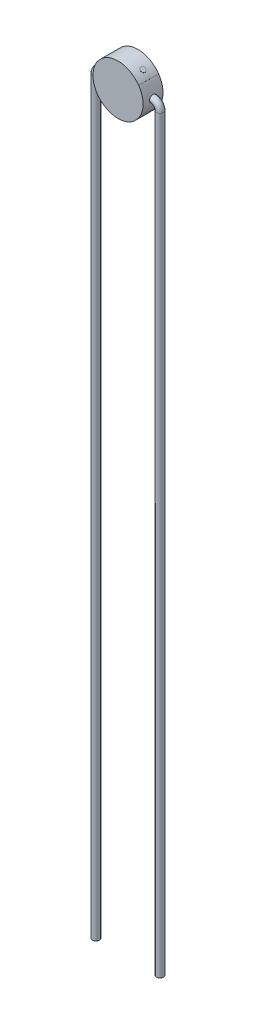
ISO-10303-21;
HEADER;
FILE_DESCRIPTION(('STEP AP214'),'2;1');
FILE_NAME('part.step','',(''),(''),'','','');
FILE_SCHEMA(('AUTOMOTIVE_DESIGN { 1 0 10303 214 1 1 1 1 }'));
ENDSEC;
DATA;
#1=APPLICATION_CONTEXT('core data for automotive mechanical design processes');
#2=APPLICATION_PROTOCOL_DEFINITION('international standard','automotive_design',2000,#1);
#3=PRODUCT_CONTEXT('',#1,'mechanical');
#4=PRODUCT('Part','Part','',(#3));
#5=PRODUCT_RELATED_PRODUCT_CATEGORY('part','',(#4));
#6=PRODUCT_DEFINITION_FORMATION('','',#4);
#7=PRODUCT_DEFINITION_CONTEXT('part definition',#1,'design');
#8=PRODUCT_DEFINITION('design','',#6,#7);
#9=PRODUCT_DEFINITION_SHAPE('','',#8);
#10=(LENGTH_UNIT() NAMED_UNIT(*) SI_UNIT(.MILLI.,.METRE.));
#11=(NAMED_UNIT(*) PLANE_ANGLE_UNIT() SI_UNIT($,.RADIAN.));
#12=(NAMED_UNIT(*) SI_UNIT($,.STERADIAN.) SOLID_ANGLE_UNIT());
#13=UNCERTAINTY_MEASURE_WITH_UNIT(LENGTH_MEASURE(1.E-05),#10,'distance_accuracy_value','');
#14=(GEOMETRIC_REPRESENTATION_CONTEXT(3) GLOBAL_UNCERTAINTY_ASSIGNED_CONTEXT((#13)) GLOBAL_UNIT_ASSIGNED_CONTEXT((#10,
#11,#12)) REPRESENTATION_CONTEXT('',''));
#15=CARTESIAN_POINT('',(0.,0.,0.));
#16=DIRECTION('',(0.,0.,1.));
#17=DIRECTION('',(1.,0.,0.));
#18=AXIS2_PLACEMENT_3D('',#15,#16,#17);
#19=CARTESIAN_POINT('',(-2.51000000000001,0.,0.));
#20=DIRECTION('',(-1.,0.,0.));
#21=DIRECTION('',(0.,0.,1.));
#22=AXIS2_PLACEMENT_3D('',#19,#20,#21);
#23=PLANE('',#22);
#24=CARTESIAN_POINT('',(-2.51000000000001,0.,0.));
#25=DIRECTION('',(-1.,0.,0.));
#26=DIRECTION('',(0.,0.,1.));
#27=AXIS2_PLACEMENT_3D('',#24,#25,#26);
#28=CIRCLE('',#27,0.35);
#29=CARTESIAN_POINT('',(-2.51,0.,0.350000000000018));
#30=VERTEX_POINT('',#29);
#31=EDGE_CURVE('E95',#30,#30,#28,.T.);
#32=ORIENTED_EDGE('',*,*,#31,.F.);
#33=EDGE_LOOP('',(#32));
#34=FACE_BOUND('',#33,.T.);
#35=ADVANCED_FACE('F83',(#34),#23,.F.);
#36=CARTESIAN_POINT('',(-3.21000000000002,-75.7,0.));
#37=DIRECTION('',(0.,-1.,0.));
#38=DIRECTION('',(0.,0.,1.));
#39=AXIS2_PLACEMENT_3D('',#36,#37,#38);
#40=PLANE('',#39);
#41=CARTESIAN_POINT('',(-3.21000000000002,-75.7,0.));
#42=DIRECTION('',(0.,-1.,0.));
#43=DIRECTION('',(0.,0.,1.));
#44=AXIS2_PLACEMENT_3D('',#41,#42,#43);
#45=CIRCLE('',#44,0.35);
#46=CARTESIAN_POINT('',(-3.21000000000001,-75.7,0.350000000000022));
#47=VERTEX_POINT('',#46);
#48=EDGE_CURVE('E15',#47,#47,#45,.T.);
#49=ORIENTED_EDGE('',*,*,#48,.T.);
#50=EDGE_LOOP('',(#49));
#51=FACE_BOUND('',#50,.T.);
#52=ADVANCED_FACE('F98',(#51),#40,.T.);
#53=CARTESIAN_POINT('',(-2.51000000000001,-0.7,0.));
#54=DIRECTION('',(0.,0.,1.));
#55=DIRECTION('',(1.,0.,0.));
#56=AXIS2_PLACEMENT_3D('',#53,#54,#55);
#57=TOROIDAL_SURFACE('',#56,0.7,0.35);
#58=CARTESIAN_POINT('',(-3.21000000000001,-0.7,0.));
#59=DIRECTION('',(0.,-1.,0.));
#60=DIRECTION('',(0.,0.,1.));
#61=AXIS2_PLACEMENT_3D('',#58,#59,#60);
#62=CIRCLE('',#61,0.35);
#63=CARTESIAN_POINT('',(-3.21,-0.7,0.350000000000022));
#64=VERTEX_POINT('',#63);
#65=EDGE_CURVE('E90',#64,#64,#62,.T.);
#66=ORIENTED_EDGE('',*,*,#65,.F.);
#67=EDGE_LOOP('',(#66));
#68=FACE_BOUND('',#67,.T.);
#69=ORIENTED_EDGE('',*,*,#31,.T.);
#70=EDGE_LOOP('',(#69));
#71=FACE_BOUND('',#70,.T.);
#72=ADVANCED_FACE('F103',(#68,#71),#57,.T.);
#73=CARTESIAN_POINT('',(-3.21000000000001,-0.7,0.));
#74=DIRECTION('',(0.,-1.,0.));
#75=DIRECTION('',(1.,0.,0.));
#76=AXIS2_PLACEMENT_3D('',#73,#74,#75);
#77=CYLINDRICAL_SURFACE('',#76,0.35);
#78=ORIENTED_EDGE('',*,*,#48,.F.);
#79=EDGE_LOOP('',(#78));
#80=FACE_BOUND('',#79,.T.);
#81=ORIENTED_EDGE('',*,*,#65,.T.);
#82=EDGE_LOOP('',(#81));
#83=FACE_BOUND('',#82,.T.);
#84=ADVANCED_FACE('F100',(#80,#83),#77,.T.);
#85=CLOSED_SHELL('',(#35,#52,#72,#84));
#86=MANIFOLD_SOLID_BREP('B2',#85);
#87=CARTESIAN_POINT('',(2.51,0.,0.));
#88=DIRECTION('',(-1.,0.,0.));
#89=DIRECTION('',(0.,-1.,0.));
#90=AXIS2_PLACEMENT_3D('',#87,#88,#89);
#91=PLANE('',#90);
#92=CARTESIAN_POINT('',(2.51,0.,0.));
#93=DIRECTION('',(-1.,0.,0.));
#94=DIRECTION('',(0.,-1.,0.));
#95=AXIS2_PLACEMENT_3D('',#92,#93,#94);
#96=CIRCLE('',#95,0.35);
#97=CARTESIAN_POINT('',(2.51,-0.35,0.));
#98=VERTEX_POINT('',#97);
#99=EDGE_CURVE('E166',#98,#98,#96,.T.);
#100=ORIENTED_EDGE('',*,*,#99,.T.);
#101=EDGE_LOOP('',(#100));
#102=FACE_BOUND('',#101,.T.);
#103=ADVANCED_FACE('F154',(#102),#91,.T.);
#104=CARTESIAN_POINT('',(3.21000000000001,-75.7,0.));
#105=DIRECTION('',(0.,1.,0.));
#106=DIRECTION('',(-1.,0.,0.));
#107=AXIS2_PLACEMENT_3D('',#104,#105,#106);
#108=PLANE('',#107);
#109=CARTESIAN_POINT('',(3.21000000000001,-75.7,0.));
#110=DIRECTION('',(0.,1.,0.));
#111=DIRECTION('',(-1.,0.,0.));
#112=AXIS2_PLACEMENT_3D('',#109,#110,#111);
#113=CIRCLE('',#112,0.35);
#114=CARTESIAN_POINT('',(2.86000000000001,-75.7,0.));
#115=VERTEX_POINT('',#114);
#116=EDGE_CURVE('E81',#115,#115,#113,.T.);
#117=ORIENTED_EDGE('',*,*,#116,.F.);
#118=EDGE_LOOP('',(#117));
#119=FACE_BOUND('',#118,.T.);
#120=ADVANCED_FACE('F172',(#119),#108,.F.);
#121=CARTESIAN_POINT('',(2.51,-0.7,0.));
#122=DIRECTION('',(0.,0.,-1.));
#123=DIRECTION('',(-1.,0.,0.));
#124=AXIS2_PLACEMENT_3D('',#121,#122,#123);
#125=TOROIDAL_SURFACE('',#124,0.7,0.35);
#126=CARTESIAN_POINT('',(3.21000000000001,-0.700000000000006,0.));
#127=DIRECTION('',(0.,1.,0.));
#128=DIRECTION('',(-1.,0.,0.));
#129=AXIS2_PLACEMENT_3D('',#126,#127,#128);
#130=CIRCLE('',#129,0.35);
#131=CARTESIAN_POINT('',(2.86000000000001,-0.700000000000006,0.));
#132=VERTEX_POINT('',#131);
#133=EDGE_CURVE('E161',#132,#132,#130,.T.);
#134=ORIENTED_EDGE('',*,*,#133,.T.);
#135=EDGE_LOOP('',(#134));
#136=FACE_BOUND('',#135,.T.);
#137=ORIENTED_EDGE('',*,*,#99,.F.);
#138=EDGE_LOOP('',(#137));
#139=FACE_BOUND('',#138,.T.);
#140=ADVANCED_FACE('F174',(#136,#139),#125,.T.);
#141=CARTESIAN_POINT('',(3.21,-0.700000000000006,0.));
#142=DIRECTION('',(0.,-1.,0.));
#143=DIRECTION('',(1.,0.,0.));
#144=AXIS2_PLACEMENT_3D('',#141,#142,#143);
#145=CYLINDRICAL_SURFACE('',#144,0.35);
#146=ORIENTED_EDGE('',*,*,#116,.T.);
#147=EDGE_LOOP('',(#146));
#148=FACE_BOUND('',#147,.T.);
#149=ORIENTED_EDGE('',*,*,#133,.F.);
#150=EDGE_LOOP('',(#149));
#151=FACE_BOUND('',#150,.T.);
#152=ADVANCED_FACE('F169',(#148,#151),#145,.T.);
#153=CLOSED_SHELL('',(#103,#120,#140,#152));
#154=MANIFOLD_SOLID_BREP('B9',#153);
#155=CARTESIAN_POINT('',(1.506,2.008,0.));
#156=DIRECTION('',(-0.6,-0.8,0.));
#157=DIRECTION('',(0.8,-0.6,0.));
#158=AXIS2_PLACEMENT_3D('',#155,#156,#157);
#159=CYLINDRICAL_SURFACE('',#158,0.25);
#160=CARTESIAN_POINT('',(1.506,2.008,0.));
#161=DIRECTION('',(0.6,0.8,0.));
#162=DIRECTION('',(-0.8,0.6,0.));
#163=AXIS2_PLACEMENT_3D('',#160,#161,#162);
#164=CIRCLE('',#163,0.25);
#165=CARTESIAN_POINT('',(1.306,2.158,0.));
#166=VERTEX_POINT('',#165);
#167=EDGE_CURVE('E153',#166,#166,#164,.T.);
#168=ORIENTED_EDGE('',*,*,#167,.F.);
#169=EDGE_LOOP('',(#168));
#170=FACE_BOUND('',#169,.T.);
#171=CARTESIAN_POINT('',(1.5,2.,0.));
#172=DIRECTION('',(0.6,0.8,0.));
#173=DIRECTION('',(-0.8,0.6,0.));
#174=AXIS2_PLACEMENT_3D('',#171,#172,#173);
#175=CIRCLE('',#174,0.25);
#176=CARTESIAN_POINT('',(1.3,2.15,0.));
#177=VERTEX_POINT('',#176);
#178=EDGE_CURVE('E225',#177,#177,#175,.T.);
#179=ORIENTED_EDGE('',*,*,#178,.T.);
#180=EDGE_LOOP('',(#179));
#181=FACE_BOUND('',#180,.T.);
#182=ADVANCED_FACE('F222',(#170,#181),#159,.T.);
#183=CARTESIAN_POINT('',(1.506,2.008,0.));
#184=DIRECTION('',(0.6,0.8,0.));
#185=DIRECTION('',(-0.8,0.6,0.));
#186=AXIS2_PLACEMENT_3D('',#183,#184,#185);
#187=PLANE('',#186);
#188=ORIENTED_EDGE('',*,*,#167,.T.);
#189=EDGE_LOOP('',(#188));
#190=FACE_BOUND('',#189,.T.);
#191=ADVANCED_FACE('F237',(#190),#187,.T.);
#192=CARTESIAN_POINT('',(1.5,2.,0.));
#193=DIRECTION('',(0.6,0.8,0.));
#194=DIRECTION('',(-0.8,0.6,0.));
#195=AXIS2_PLACEMENT_3D('',#192,#193,#194);
#196=PLANE('',#195);
#197=ORIENTED_EDGE('',*,*,#178,.F.);
#198=EDGE_LOOP('',(#197));
#199=FACE_BOUND('',#198,.T.);
#200=ADVANCED_FACE('F235',(#199),#196,.F.);
#201=CLOSED_SHELL('',(#182,#191,#200));
#202=MANIFOLD_SOLID_BREP('B75',#201);
#203=CARTESIAN_POINT('',(0.,0.,1.));
#204=DIRECTION('',(0.,0.,-1.));
#205=DIRECTION('',(-1.,0.,0.));
#206=AXIS2_PLACEMENT_3D('',#203,#204,#205);
#207=CYLINDRICAL_SURFACE('',#206,2.5);
#208=DIRECTION('',(0.,0.,1.));
#209=VECTOR('',#208,1.);
#210=CARTESIAN_POINT('',(-2.0633390372742,-1.41160618348759,-1.));
#211=LINE('',#210,#209);
#212=CARTESIAN_POINT('',(-2.0633390372742,-1.41160618348759,-1.));
#213=VERTEX_POINT('',#212);
#214=CARTESIAN_POINT('',(-2.0633390372742,-1.41160618348759,1.));
#215=VERTEX_POINT('',#214);
#216=EDGE_CURVE('E361',#213,#215,#211,.T.);
#217=ORIENTED_EDGE('',*,*,#216,.F.);
#218=CARTESIAN_POINT('',(0.,0.,-1.));
#219=DIRECTION('',(0.,0.,1.));
#220=DIRECTION('',(1.,0.,0.));
#221=AXIS2_PLACEMENT_3D('',#218,#219,#220);
#222=CIRCLE('',#221,2.5);
#223=CARTESIAN_POINT('',(2.0633390372742,-1.41160618348759,-1.));
#224=VERTEX_POINT('',#223);
#225=EDGE_CURVE('E388',#213,#224,#222,.T.);
#226=ORIENTED_EDGE('',*,*,#225,.T.);
#227=DIRECTION('',(0.,0.,1.));
#228=VECTOR('',#227,1.);
#229=CARTESIAN_POINT('',(2.0633390372742,-1.41160618348759,-1.));
#230=LINE('',#229,#228);
#231=CARTESIAN_POINT('',(2.0633390372742,-1.41160618348759,1.));
#232=VERTEX_POINT('',#231);
#233=EDGE_CURVE('E377',#224,#232,#230,.T.);
#234=ORIENTED_EDGE('',*,*,#233,.T.);
#235=CARTESIAN_POINT('',(0.,0.,1.));
#236=DIRECTION('',(0.,0.,1.));
#237=DIRECTION('',(1.,0.,0.));
#238=AXIS2_PLACEMENT_3D('',#235,#236,#237);
#239=CIRCLE('',#238,2.5);
#240=EDGE_CURVE('E275',#215,#232,#239,.T.);
#241=ORIENTED_EDGE('',*,*,#240,.F.);
#242=EDGE_LOOP('',(#217,#226,#234,#241));
#243=FACE_BOUND('',#242,.T.);
#244=ADVANCED_FACE('F267',(#243),#207,.T.);
#245=DIRECTION('',(0.,0.,1.));
#246=VECTOR('',#245,1.);
#247=CARTESIAN_POINT('',(-2.0633390372742,1.41160618348759,-1.));
#248=LINE('',#247,#246);
#249=CARTESIAN_POINT('',(-2.0633390372742,1.41160618348759,-1.));
#250=VERTEX_POINT('',#249);
#251=CARTESIAN_POINT('',(-2.0633390372742,1.41160618348759,1.));
#252=VERTEX_POINT('',#251);
#253=EDGE_CURVE('E289',#250,#252,#248,.T.);
#254=ORIENTED_EDGE('',*,*,#253,.T.);
#255=CARTESIAN_POINT('',(2.0633390372742,1.41160618348759,1.));
#256=VERTEX_POINT('',#255);
#257=EDGE_CURVE('E220',#256,#252,#239,.T.);
#258=ORIENTED_EDGE('',*,*,#257,.F.);
#259=DIRECTION('',(0.,0.,1.));
#260=VECTOR('',#259,1.);
#261=CARTESIAN_POINT('',(2.0633390372742,1.41160618348759,-1.));
#262=LINE('',#261,#260);
#263=CARTESIAN_POINT('',(2.0633390372742,1.41160618348759,-1.));
#264=VERTEX_POINT('',#263);
#265=EDGE_CURVE('E385',#264,#256,#262,.T.);
#266=ORIENTED_EDGE('',*,*,#265,.F.);
#267=EDGE_CURVE('E270',#264,#250,#222,.T.);
#268=ORIENTED_EDGE('',*,*,#267,.T.);
#269=EDGE_LOOP('',(#254,#258,#266,#268));
#270=FACE_BOUND('',#269,.T.);
#271=ADVANCED_FACE('F403',(#270),#207,.T.);
#272=CARTESIAN_POINT('',(0.,0.,1.));
#273=DIRECTION('',(0.,0.,1.));
#274=DIRECTION('',(1.,0.,0.));
#275=AXIS2_PLACEMENT_3D('',#272,#273,#274);
#276=PLANE('',#275);
#277=ORIENTED_EDGE('',*,*,#257,.T.);
#278=DIRECTION('',(0.825335614909667,-0.564642473395052,0.));
#279=VECTOR('',#278,1.);
#280=CARTESIAN_POINT('',(-2.0633390372742,1.41160618348759,1.));
#281=LINE('',#280,#279);
#282=CARTESIAN_POINT('',(-2.07159239342329,1.41725260822154,1.));
#283=VERTEX_POINT('',#282);
#284=EDGE_CURVE('E358',#283,#252,#281,.T.);
#285=ORIENTED_EDGE('',*,*,#284,.F.);
#286=CARTESIAN_POINT('',(0.,0.,1.));
#287=DIRECTION('',(0.,0.,-1.));
#288=DIRECTION('',(1.,0.,0.));
#289=AXIS2_PLACEMENT_3D('',#286,#287,#288);
#290=CIRCLE('',#289,2.51);
#291=CARTESIAN_POINT('',(-2.07159239342329,-1.41725260822154,1.));
#292=VERTEX_POINT('',#291);
#293=EDGE_CURVE('E346',#292,#283,#290,.T.);
#294=ORIENTED_EDGE('',*,*,#293,.F.);
#295=DIRECTION('',(-0.825335614909681,-0.564642473395032,0.));
#296=VECTOR('',#295,1.);
#297=CARTESIAN_POINT('',(-2.0633390372742,-1.41160618348759,1.));
#298=LINE('',#297,#296);
#299=EDGE_CURVE('E353',#215,#292,#298,.T.);
#300=ORIENTED_EDGE('',*,*,#299,.F.);
#301=ORIENTED_EDGE('',*,*,#240,.T.);
#302=DIRECTION('',(0.825335614909681,-0.564642473395032,0.));
#303=VECTOR('',#302,1.);
#304=CARTESIAN_POINT('',(2.0633390372742,-1.41160618348759,1.));
#305=LINE('',#304,#303);
#306=CARTESIAN_POINT('',(2.07159239342329,-1.41725260822154,1.));
#307=VERTEX_POINT('',#306);
#308=EDGE_CURVE('E364',#232,#307,#305,.T.);
#309=ORIENTED_EDGE('',*,*,#308,.T.);
#310=CARTESIAN_POINT('',(0.,0.,1.));
#311=DIRECTION('',(0.,0.,1.));
#312=DIRECTION('',(-1.,0.,0.));
#313=AXIS2_PLACEMENT_3D('',#310,#311,#312);
#314=CIRCLE('',#313,2.51);
#315=CARTESIAN_POINT('',(2.07159239342329,1.41725260822154,1.));
#316=VERTEX_POINT('',#315);
#317=EDGE_CURVE('E380',#307,#316,#314,.T.);
#318=ORIENTED_EDGE('',*,*,#317,.T.);
#319=DIRECTION('',(-0.825335614909667,-0.564642473395052,0.));
#320=VECTOR('',#319,1.);
#321=CARTESIAN_POINT('',(2.0633390372742,1.41160618348759,1.));
#322=LINE('',#321,#320);
#323=EDGE_CURVE('E371',#316,#256,#322,.T.);
#324=ORIENTED_EDGE('',*,*,#323,.T.);
#325=EDGE_LOOP('',(#277,#285,#294,#300,#301,#309,#318,#324));
#326=FACE_BOUND('',#325,.T.);
#327=ADVANCED_FACE('F400',(#326),#276,.T.);
#328=CARTESIAN_POINT('',(0.,0.,-1.));
#329=DIRECTION('',(0.,0.,1.));
#330=DIRECTION('',(1.,0.,0.));
#331=AXIS2_PLACEMENT_3D('',#328,#329,#330);
#332=PLANE('',#331);
#333=ORIENTED_EDGE('',*,*,#267,.F.);
#334=DIRECTION('',(-0.825335614909667,-0.564642473395052,0.));
#335=VECTOR('',#334,1.);
#336=CARTESIAN_POINT('',(2.0633390372742,1.41160618348759,-1.));
#337=LINE('',#336,#335);
#338=CARTESIAN_POINT('',(2.07159239342329,1.41725260822154,-1.));
#339=VERTEX_POINT('',#338);
#340=EDGE_CURVE('E374',#339,#264,#337,.T.);
#341=ORIENTED_EDGE('',*,*,#340,.F.);
#342=CARTESIAN_POINT('',(0.,0.,-1.));
#343=DIRECTION('',(0.,0.,1.));
#344=DIRECTION('',(-1.,0.,0.));
#345=AXIS2_PLACEMENT_3D('',#342,#343,#344);
#346=CIRCLE('',#345,2.51);
#347=CARTESIAN_POINT('',(2.07159239342329,-1.41725260822154,-1.));
#348=VERTEX_POINT('',#347);
#349=EDGE_CURVE('E370',#348,#339,#346,.T.);
#350=ORIENTED_EDGE('',*,*,#349,.F.);
#351=DIRECTION('',(0.825335614909681,-0.564642473395032,0.));
#352=VECTOR('',#351,1.);
#353=CARTESIAN_POINT('',(2.0633390372742,-1.41160618348759,-1.));
#354=LINE('',#353,#352);
#355=EDGE_CURVE('E367',#224,#348,#354,.T.);
#356=ORIENTED_EDGE('',*,*,#355,.F.);
#357=ORIENTED_EDGE('',*,*,#225,.F.);
#358=DIRECTION('',(-0.825335614909681,-0.564642473395032,0.));
#359=VECTOR('',#358,1.);
#360=CARTESIAN_POINT('',(-2.0633390372742,-1.41160618348759,-1.));
#361=LINE('',#360,#359);
#362=CARTESIAN_POINT('',(-2.07159239342329,-1.41725260822154,-1.));
#363=VERTEX_POINT('',#362);
#364=EDGE_CURVE('E337',#213,#363,#361,.T.);
#365=ORIENTED_EDGE('',*,*,#364,.T.);
#366=CARTESIAN_POINT('',(0.,0.,-1.));
#367=DIRECTION('',(0.,0.,-1.));
#368=DIRECTION('',(1.,0.,0.));
#369=AXIS2_PLACEMENT_3D('',#366,#367,#368);
#370=CIRCLE('',#369,2.51);
#371=CARTESIAN_POINT('',(-2.07159239342329,1.41725260822154,-1.));
#372=VERTEX_POINT('',#371);
#373=EDGE_CURVE('E331',#363,#372,#370,.T.);
#374=ORIENTED_EDGE('',*,*,#373,.T.);
#375=DIRECTION('',(0.825335614909667,-0.564642473395052,0.));
#376=VECTOR('',#375,1.);
#377=CARTESIAN_POINT('',(-2.0633390372742,1.41160618348759,-1.));
#378=LINE('',#377,#376);
#379=EDGE_CURVE('E335',#372,#250,#378,.T.);
#380=ORIENTED_EDGE('',*,*,#379,.T.);
#381=EDGE_LOOP('',(#333,#341,#350,#356,#357,#365,#374,#380));
#382=FACE_BOUND('',#381,.T.);
#383=ADVANCED_FACE('F333',(#382),#332,.F.);
#384=CARTESIAN_POINT('',(2.0633390372742,1.41160618348759,-1.));
#385=DIRECTION('',(-0.564642473395052,0.825335614909667,0.));
#386=DIRECTION('',(-0.825335614909667,-0.564642473395052,0.));
#387=AXIS2_PLACEMENT_3D('',#384,#385,#386);
#388=PLANE('',#387);
#389=ORIENTED_EDGE('',*,*,#323,.F.);
#390=DIRECTION('',(0.,0.,1.));
#391=VECTOR('',#390,1.);
#392=CARTESIAN_POINT('',(2.07159239342329,1.41725260822154,-1.));
#393=LINE('',#392,#391);
#394=EDGE_CURVE('E389',#339,#316,#393,.T.);
#395=ORIENTED_EDGE('',*,*,#394,.F.);
#396=ORIENTED_EDGE('',*,*,#340,.T.);
#397=ORIENTED_EDGE('',*,*,#265,.T.);
#398=EDGE_LOOP('',(#389,#395,#396,#397));
#399=FACE_BOUND('',#398,.T.);
#400=ADVANCED_FACE('F407',(#399),#388,.T.);
#401=CARTESIAN_POINT('',(0.,0.,-1.));
#402=DIRECTION('',(0.,0.,1.));
#403=DIRECTION('',(1.,0.,0.));
#404=AXIS2_PLACEMENT_3D('',#401,#402,#403);
#405=CYLINDRICAL_SURFACE('',#404,2.51);
#406=ORIENTED_EDGE('',*,*,#317,.F.);
#407=DIRECTION('',(0.,0.,1.));
#408=VECTOR('',#407,1.);
#409=CARTESIAN_POINT('',(2.07159239342329,-1.41725260822154,-1.));
#410=LINE('',#409,#408);
#411=EDGE_CURVE('E391',#348,#307,#410,.T.);
#412=ORIENTED_EDGE('',*,*,#411,.F.);
#413=ORIENTED_EDGE('',*,*,#349,.T.);
#414=ORIENTED_EDGE('',*,*,#394,.T.);
#415=EDGE_LOOP('',(#406,#412,#413,#414));
#416=FACE_BOUND('',#415,.T.);
#417=ADVANCED_FACE('F409',(#416),#405,.T.);
#418=CARTESIAN_POINT('',(2.0633390372742,-1.41160618348759,-1.));
#419=DIRECTION('',(-0.564642473395032,-0.825335614909681,0.));
#420=DIRECTION('',(0.825335614909681,-0.564642473395032,0.));
#421=AXIS2_PLACEMENT_3D('',#418,#419,#420);
#422=PLANE('',#421);
#423=ORIENTED_EDGE('',*,*,#308,.F.);
#424=ORIENTED_EDGE('',*,*,#233,.F.);
#425=ORIENTED_EDGE('',*,*,#355,.T.);
#426=ORIENTED_EDGE('',*,*,#411,.T.);
#427=EDGE_LOOP('',(#423,#424,#425,#426));
#428=FACE_BOUND('',#427,.T.);
#429=ADVANCED_FACE('F397',(#428),#422,.T.);
#430=CARTESIAN_POINT('',(-2.0633390372742,-1.41160618348759,-1.));
#431=DIRECTION('',(-0.564642473395032,0.825335614909681,0.));
#432=DIRECTION('',(-0.825335614909681,-0.564642473395032,0.));
#433=AXIS2_PLACEMENT_3D('',#430,#431,#432);
#434=PLANE('',#433);
#435=ORIENTED_EDGE('',*,*,#299,.T.);
#436=DIRECTION('',(0.,0.,1.));
#437=VECTOR('',#436,1.);
#438=CARTESIAN_POINT('',(-2.07159239342329,-1.41725260822154,-1.));
#439=LINE('',#438,#437);
#440=EDGE_CURVE('E350',#363,#292,#439,.T.);
#441=ORIENTED_EDGE('',*,*,#440,.F.);
#442=ORIENTED_EDGE('',*,*,#364,.F.);
#443=ORIENTED_EDGE('',*,*,#216,.T.);
#444=EDGE_LOOP('',(#435,#441,#442,#443));
#445=FACE_BOUND('',#444,.T.);
#446=ADVANCED_FACE('F416',(#445),#434,.F.);
#447=CARTESIAN_POINT('',(0.,0.,-1.));
#448=DIRECTION('',(0.,0.,1.));
#449=DIRECTION('',(1.,0.,0.));
#450=AXIS2_PLACEMENT_3D('',#447,#448,#449);
#451=CYLINDRICAL_SURFACE('',#450,2.51);
#452=ORIENTED_EDGE('',*,*,#293,.T.);
#453=DIRECTION('',(0.,0.,1.));
#454=VECTOR('',#453,1.);
#455=CARTESIAN_POINT('',(-2.07159239342329,1.41725260822154,-1.));
#456=LINE('',#455,#454);
#457=EDGE_CURVE('E343',#372,#283,#456,.T.);
#458=ORIENTED_EDGE('',*,*,#457,.F.);
#459=ORIENTED_EDGE('',*,*,#373,.F.);
#460=ORIENTED_EDGE('',*,*,#440,.T.);
#461=EDGE_LOOP('',(#452,#458,#459,#460));
#462=FACE_BOUND('',#461,.T.);
#463=ADVANCED_FACE('F344',(#462),#451,.T.);
#464=CARTESIAN_POINT('',(-2.0633390372742,1.41160618348759,-1.));
#465=DIRECTION('',(-0.564642473395052,-0.825335614909667,0.));
#466=DIRECTION('',(0.825335614909667,-0.564642473395052,0.));
#467=AXIS2_PLACEMENT_3D('',#464,#465,#466);
#468=PLANE('',#467);
#469=ORIENTED_EDGE('',*,*,#284,.T.);
#470=ORIENTED_EDGE('',*,*,#253,.F.);
#471=ORIENTED_EDGE('',*,*,#379,.F.);
#472=ORIENTED_EDGE('',*,*,#457,.T.);
#473=EDGE_LOOP('',(#469,#470,#471,#472));
#474=FACE_BOUND('',#473,.T.);
#475=ADVANCED_FACE('F352',(#474),#468,.F.);
#476=CLOSED_SHELL('',(#244,#271,#327,#383,#400,#417,#429,#446,#463,#475));
#477=MANIFOLD_SOLID_BREP('B148',#476);
#478=ADVANCED_BREP_SHAPE_REPRESENTATION('',(#18,#86,#154,#202,#477),#14);
#479=SHAPE_DEFINITION_REPRESENTATION(#9,#478);
ENDSEC;
END-ISO-10303-21;
